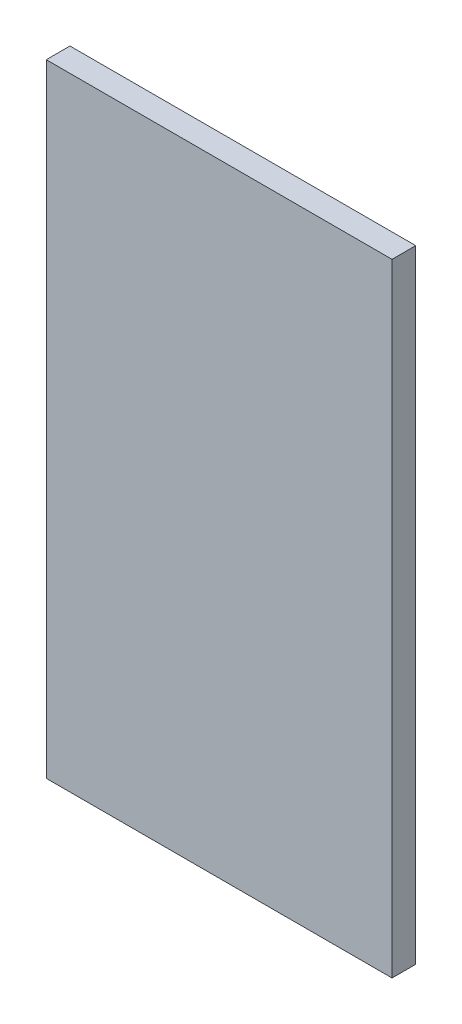
ISO-10303-21;
HEADER;
FILE_DESCRIPTION(('STEP AP214'),'2;1');
FILE_NAME('part.step','',(''),(''),'','','');
FILE_SCHEMA(('AUTOMOTIVE_DESIGN { 1 0 10303 214 1 1 1 1 }'));
ENDSEC;
DATA;
#1=APPLICATION_CONTEXT('core data for automotive mechanical design processes');
#2=APPLICATION_PROTOCOL_DEFINITION('international standard','automotive_design',2000,#1);
#3=PRODUCT_CONTEXT('',#1,'mechanical');
#4=PRODUCT('Part','Part','',(#3));
#5=PRODUCT_RELATED_PRODUCT_CATEGORY('part','',(#4));
#6=PRODUCT_DEFINITION_FORMATION('','',#4);
#7=PRODUCT_DEFINITION_CONTEXT('part definition',#1,'design');
#8=PRODUCT_DEFINITION('design','',#6,#7);
#9=PRODUCT_DEFINITION_SHAPE('','',#8);
#10=(LENGTH_UNIT() NAMED_UNIT(*) SI_UNIT(.MILLI.,.METRE.));
#11=(NAMED_UNIT(*) PLANE_ANGLE_UNIT() SI_UNIT($,.RADIAN.));
#12=(NAMED_UNIT(*) SI_UNIT($,.STERADIAN.) SOLID_ANGLE_UNIT());
#13=UNCERTAINTY_MEASURE_WITH_UNIT(LENGTH_MEASURE(1.E-05),#10,'distance_accuracy_value','');
#14=(GEOMETRIC_REPRESENTATION_CONTEXT(3) GLOBAL_UNCERTAINTY_ASSIGNED_CONTEXT((#13)) GLOBAL_UNIT_ASSIGNED_CONTEXT((#10,
#11,#12)) REPRESENTATION_CONTEXT('',''));
#15=CARTESIAN_POINT('',(0.,0.,0.));
#16=DIRECTION('',(0.,0.,1.));
#17=DIRECTION('',(1.,0.,0.));
#18=AXIS2_PLACEMENT_3D('',#15,#16,#17);
#19=CARTESIAN_POINT('',(8.20008,10.5,0.));
#20=DIRECTION('',(0.,0.,-1.));
#21=DIRECTION('',(-1.,0.,0.));
#22=AXIS2_PLACEMENT_3D('',#19,#20,#21);
#23=PLANE('',#22);
#24=DIRECTION('',(1.,0.,0.));
#25=VECTOR('',#24,1.);
#26=CARTESIAN_POINT('',(7.95008,10.95,0.));
#27=LINE('',#26,#25);
#28=CARTESIAN_POINT('',(7.95008,10.95,0.));
#29=VERTEX_POINT('',#28);
#30=CARTESIAN_POINT('',(8.45008,10.95,0.));
#31=VERTEX_POINT('',#30);
#32=EDGE_CURVE('E55',#29,#31,#27,.T.);
#33=ORIENTED_EDGE('',*,*,#32,.T.);
#34=DIRECTION('',(0.,1.,0.));
#35=VECTOR('',#34,1.);
#36=CARTESIAN_POINT('',(8.45008,10.95,0.));
#37=LINE('',#36,#35);
#38=CARTESIAN_POINT('',(8.45008,10.05,0.));
#39=VERTEX_POINT('',#38);
#40=EDGE_CURVE('E57',#31,#39,#37,.F.);
#41=ORIENTED_EDGE('',*,*,#40,.T.);
#42=DIRECTION('',(1.,0.,0.));
#43=VECTOR('',#42,1.);
#44=CARTESIAN_POINT('',(8.45008,10.05,0.));
#45=LINE('',#44,#43);
#46=CARTESIAN_POINT('',(7.95008,10.05,0.));
#47=VERTEX_POINT('',#46);
#48=EDGE_CURVE('E20',#39,#47,#45,.F.);
#49=ORIENTED_EDGE('',*,*,#48,.T.);
#50=DIRECTION('',(0.,1.,0.));
#51=VECTOR('',#50,1.);
#52=CARTESIAN_POINT('',(7.95008,10.05,0.));
#53=LINE('',#52,#51);
#54=EDGE_CURVE('E80',#47,#29,#53,.T.);
#55=ORIENTED_EDGE('',*,*,#54,.T.);
#56=EDGE_LOOP('',(#33,#41,#49,#55));
#57=FACE_BOUND('',#56,.T.);
#58=ADVANCED_FACE('F17',(#57),#23,.T.);
#59=CARTESIAN_POINT('',(8.45008,10.05,0.));
#60=DIRECTION('',(0.,1.,0.));
#61=DIRECTION('',(0.,0.,1.));
#62=AXIS2_PLACEMENT_3D('',#59,#60,#61);
#63=PLANE('',#62);
#64=DIRECTION('',(0.,0.,-1.));
#65=VECTOR('',#64,1.);
#66=CARTESIAN_POINT('',(7.95008,10.05,0.));
#67=LINE('',#66,#65);
#68=CARTESIAN_POINT('',(7.95008,10.05,0.03429));
#69=VERTEX_POINT('',#68);
#70=EDGE_CURVE('E68',#69,#47,#67,.T.);
#71=ORIENTED_EDGE('',*,*,#70,.T.);
#72=ORIENTED_EDGE('',*,*,#48,.F.);
#73=DIRECTION('',(0.,0.,1.));
#74=VECTOR('',#73,1.);
#75=CARTESIAN_POINT('',(8.45008,10.05,0.));
#76=LINE('',#75,#74);
#77=CARTESIAN_POINT('',(8.45008,10.05,0.03429));
#78=VERTEX_POINT('',#77);
#79=EDGE_CURVE('E63',#39,#78,#76,.T.);
#80=ORIENTED_EDGE('',*,*,#79,.T.);
#81=DIRECTION('',(1.,0.,0.));
#82=VECTOR('',#81,1.);
#83=CARTESIAN_POINT('',(8.20008,10.05,0.03429));
#84=LINE('',#83,#82);
#85=EDGE_CURVE('E83',#69,#78,#84,.T.);
#86=ORIENTED_EDGE('',*,*,#85,.F.);
#87=EDGE_LOOP('',(#71,#72,#80,#86));
#88=FACE_BOUND('',#87,.T.);
#89=ADVANCED_FACE('F65',(#88),#63,.F.);
#90=CARTESIAN_POINT('',(8.45008,10.95,0.));
#91=DIRECTION('',(-1.,0.,0.));
#92=DIRECTION('',(0.,0.,1.));
#93=AXIS2_PLACEMENT_3D('',#90,#91,#92);
#94=PLANE('',#93);
#95=ORIENTED_EDGE('',*,*,#79,.F.);
#96=ORIENTED_EDGE('',*,*,#40,.F.);
#97=DIRECTION('',(0.,0.,-1.));
#98=VECTOR('',#97,1.);
#99=CARTESIAN_POINT('',(8.45008,10.95,0.));
#100=LINE('',#99,#98);
#101=CARTESIAN_POINT('',(8.45008,10.95,0.03429));
#102=VERTEX_POINT('',#101);
#103=EDGE_CURVE('E75',#31,#102,#100,.F.);
#104=ORIENTED_EDGE('',*,*,#103,.T.);
#105=DIRECTION('',(0.,1.,0.));
#106=VECTOR('',#105,1.);
#107=CARTESIAN_POINT('',(8.45008,10.5,0.03429));
#108=LINE('',#107,#106);
#109=EDGE_CURVE('E72',#78,#102,#108,.T.);
#110=ORIENTED_EDGE('',*,*,#109,.F.);
#111=EDGE_LOOP('',(#95,#96,#104,#110));
#112=FACE_BOUND('',#111,.T.);
#113=ADVANCED_FACE('F70',(#112),#94,.F.);
#114=CARTESIAN_POINT('',(7.95008,10.95,0.));
#115=DIRECTION('',(0.,-1.,0.));
#116=DIRECTION('',(0.,0.,-1.));
#117=AXIS2_PLACEMENT_3D('',#114,#115,#116);
#118=PLANE('',#117);
#119=ORIENTED_EDGE('',*,*,#103,.F.);
#120=ORIENTED_EDGE('',*,*,#32,.F.);
#121=DIRECTION('',(0.,0.,-1.));
#122=VECTOR('',#121,1.);
#123=CARTESIAN_POINT('',(7.95008,10.95,0.));
#124=LINE('',#123,#122);
#125=CARTESIAN_POINT('',(7.95008,10.95,0.03429));
#126=VERTEX_POINT('',#125);
#127=EDGE_CURVE('E35',#29,#126,#124,.F.);
#128=ORIENTED_EDGE('',*,*,#127,.T.);
#129=DIRECTION('',(1.,0.,0.));
#130=VECTOR('',#129,1.);
#131=CARTESIAN_POINT('',(8.20008,10.95,0.03429));
#132=LINE('',#131,#130);
#133=EDGE_CURVE('E26',#102,#126,#132,.F.);
#134=ORIENTED_EDGE('',*,*,#133,.F.);
#135=EDGE_LOOP('',(#119,#120,#128,#134));
#136=FACE_BOUND('',#135,.T.);
#137=ADVANCED_FACE('F89',(#136),#118,.F.);
#138=CARTESIAN_POINT('',(7.95008,10.05,0.));
#139=DIRECTION('',(1.,0.,0.));
#140=DIRECTION('',(0.,0.,-1.));
#141=AXIS2_PLACEMENT_3D('',#138,#139,#140);
#142=PLANE('',#141);
#143=ORIENTED_EDGE('',*,*,#127,.F.);
#144=ORIENTED_EDGE('',*,*,#54,.F.);
#145=ORIENTED_EDGE('',*,*,#70,.F.);
#146=DIRECTION('',(0.,1.,0.));
#147=VECTOR('',#146,1.);
#148=CARTESIAN_POINT('',(7.95008,10.5,0.03429));
#149=LINE('',#148,#147);
#150=EDGE_CURVE('E11',#126,#69,#149,.F.);
#151=ORIENTED_EDGE('',*,*,#150,.F.);
#152=EDGE_LOOP('',(#143,#144,#145,#151));
#153=FACE_BOUND('',#152,.T.);
#154=ADVANCED_FACE('F91',(#153),#142,.F.);
#155=CARTESIAN_POINT('',(8.20008,10.5,0.03429));
#156=DIRECTION('',(0.,0.,1.));
#157=DIRECTION('',(1.,0.,0.));
#158=AXIS2_PLACEMENT_3D('',#155,#156,#157);
#159=PLANE('',#158);
#160=ORIENTED_EDGE('',*,*,#133,.T.);
#161=ORIENTED_EDGE('',*,*,#150,.T.);
#162=ORIENTED_EDGE('',*,*,#85,.T.);
#163=ORIENTED_EDGE('',*,*,#109,.T.);
#164=EDGE_LOOP('',(#160,#161,#162,#163));
#165=FACE_BOUND('',#164,.T.);
#166=ADVANCED_FACE('F88',(#165),#159,.T.);
#167=CLOSED_SHELL('',(#58,#89,#113,#137,#154,#166));
#168=MANIFOLD_SOLID_BREP('B1',#167);
#169=ADVANCED_BREP_SHAPE_REPRESENTATION('',(#18,#168),#14);
#170=SHAPE_DEFINITION_REPRESENTATION(#9,#169);
ENDSEC;
END-ISO-10303-21;
